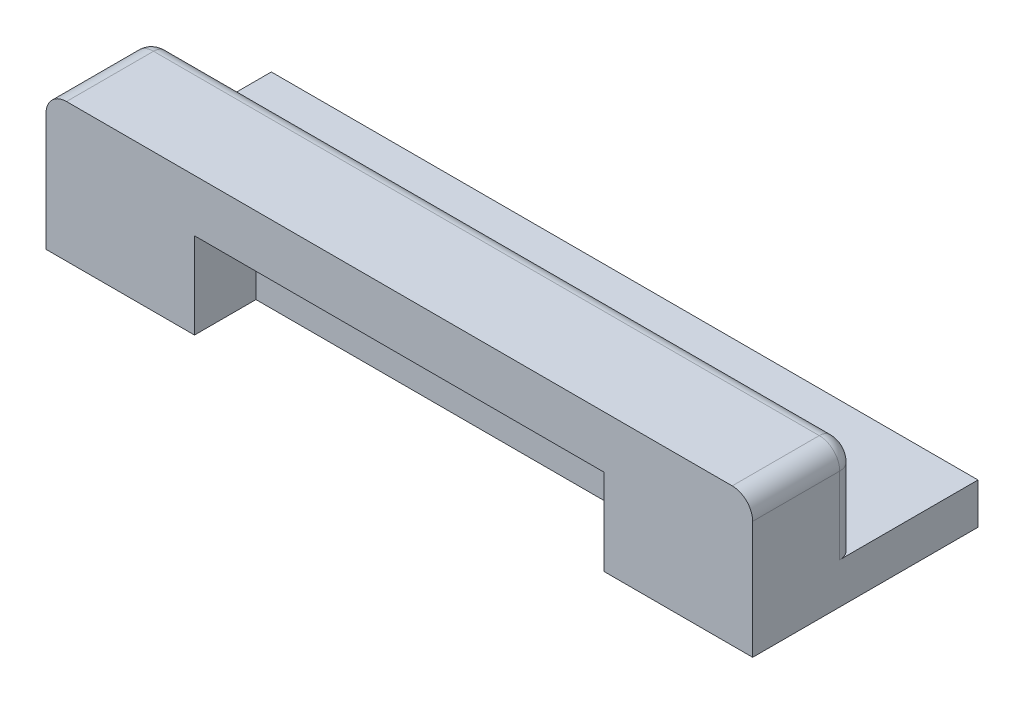
ISO-10303-21;
HEADER;
FILE_DESCRIPTION(('STEP AP214'),'2;1');
FILE_NAME('part.step','',(''),(''),'','','');
FILE_SCHEMA(('AUTOMOTIVE_DESIGN { 1 0 10303 214 1 1 1 1 }'));
ENDSEC;
DATA;
#1=APPLICATION_CONTEXT('core data for automotive mechanical design processes');
#2=APPLICATION_PROTOCOL_DEFINITION('international standard','automotive_design',2000,#1);
#3=PRODUCT_CONTEXT('',#1,'mechanical');
#4=PRODUCT('Part','Part','',(#3));
#5=PRODUCT_RELATED_PRODUCT_CATEGORY('part','',(#4));
#6=PRODUCT_DEFINITION_FORMATION('','',#4);
#7=PRODUCT_DEFINITION_CONTEXT('part definition',#1,'design');
#8=PRODUCT_DEFINITION('design','',#6,#7);
#9=PRODUCT_DEFINITION_SHAPE('','',#8);
#10=(LENGTH_UNIT() NAMED_UNIT(*) SI_UNIT(.MILLI.,.METRE.));
#11=(NAMED_UNIT(*) PLANE_ANGLE_UNIT() SI_UNIT($,.RADIAN.));
#12=(NAMED_UNIT(*) SI_UNIT($,.STERADIAN.) SOLID_ANGLE_UNIT());
#13=UNCERTAINTY_MEASURE_WITH_UNIT(LENGTH_MEASURE(1.E-05),#10,'distance_accuracy_value','');
#14=(GEOMETRIC_REPRESENTATION_CONTEXT(3) GLOBAL_UNCERTAINTY_ASSIGNED_CONTEXT((#13)) GLOBAL_UNIT_ASSIGNED_CONTEXT((#10,
#11,#12)) REPRESENTATION_CONTEXT('',''));
#15=CARTESIAN_POINT('',(0.,0.,0.));
#16=DIRECTION('',(0.,0.,1.));
#17=DIRECTION('',(1.,0.,0.));
#18=AXIS2_PLACEMENT_3D('',#15,#16,#17);
#19=CARTESIAN_POINT('',(-34.5,12.5,1.));
#20=DIRECTION('',(0.,0.,1.));
#21=DIRECTION('',(1.,0.,0.));
#22=AXIS2_PLACEMENT_3D('',#19,#20,#21);
#23=PLANE('',#22);
#24=CARTESIAN_POINT('',(32.5,10.5,1.));
#25=DIRECTION('',(0.,0.,1.));
#26=DIRECTION('',(1.,0.,0.));
#27=AXIS2_PLACEMENT_3D('',#24,#25,#26);
#28=CIRCLE('',#27,0.5);
#29=CARTESIAN_POINT('',(32.5,11.,1.));
#30=VERTEX_POINT('',#29);
#31=CARTESIAN_POINT('',(33.,10.5,1.));
#32=VERTEX_POINT('',#31);
#33=EDGE_CURVE('E280',#30,#32,#28,.F.);
#34=ORIENTED_EDGE('',*,*,#33,.T.);
#35=DIRECTION('',(0.,-1.,0.));
#36=VECTOR('',#35,1.);
#37=CARTESIAN_POINT('',(33.,3.,1.));
#38=LINE('',#37,#36);
#39=CARTESIAN_POINT('',(33.,3.,1.));
#40=VERTEX_POINT('',#39);
#41=EDGE_CURVE('E282',#32,#40,#38,.T.);
#42=ORIENTED_EDGE('',*,*,#41,.T.);
#43=DIRECTION('',(-1.,0.,0.));
#44=VECTOR('',#43,1.);
#45=CARTESIAN_POINT('',(-34.5,3.,1.));
#46=LINE('',#45,#44);
#47=CARTESIAN_POINT('',(31.5,3.,1.));
#48=VERTEX_POINT('',#47);
#49=EDGE_CURVE('E230',#40,#48,#46,.T.);
#50=ORIENTED_EDGE('',*,*,#49,.T.);
#51=DIRECTION('',(0.,1.,0.));
#52=VECTOR('',#51,1.);
#53=CARTESIAN_POINT('',(31.5,3.,1.));
#54=LINE('',#53,#52);
#55=CARTESIAN_POINT('',(31.5,7.5,1.));
#56=VERTEX_POINT('',#55);
#57=EDGE_CURVE('E205',#48,#56,#54,.T.);
#58=ORIENTED_EDGE('',*,*,#57,.T.);
#59=DIRECTION('',(1.,0.,0.));
#60=VECTOR('',#59,1.);
#61=CARTESIAN_POINT('',(-31.5,7.5,1.));
#62=LINE('',#61,#60);
#63=CARTESIAN_POINT('',(-31.5,7.5,1.));
#64=VERTEX_POINT('',#63);
#65=EDGE_CURVE('E221',#64,#56,#62,.T.);
#66=ORIENTED_EDGE('',*,*,#65,.F.);
#67=DIRECTION('',(0.,1.,0.));
#68=VECTOR('',#67,1.);
#69=CARTESIAN_POINT('',(-31.5,3.,1.));
#70=LINE('',#69,#68);
#71=CARTESIAN_POINT('',(-31.5,3.,1.));
#72=VERTEX_POINT('',#71);
#73=EDGE_CURVE('E208',#72,#64,#70,.T.);
#74=ORIENTED_EDGE('',*,*,#73,.F.);
#75=CARTESIAN_POINT('',(-33.,3.,1.));
#76=VERTEX_POINT('',#75);
#77=EDGE_CURVE('E226',#72,#76,#46,.T.);
#78=ORIENTED_EDGE('',*,*,#77,.T.);
#79=DIRECTION('',(0.,-1.,0.));
#80=VECTOR('',#79,1.);
#81=CARTESIAN_POINT('',(-33.,10.5,1.));
#82=LINE('',#81,#80);
#83=CARTESIAN_POINT('',(-33.,10.5,1.));
#84=VERTEX_POINT('',#83);
#85=EDGE_CURVE('E278',#76,#84,#82,.F.);
#86=ORIENTED_EDGE('',*,*,#85,.T.);
#87=CARTESIAN_POINT('',(-32.5,10.5,1.));
#88=DIRECTION('',(0.,0.,1.));
#89=DIRECTION('',(1.,0.,0.));
#90=AXIS2_PLACEMENT_3D('',#87,#88,#89);
#91=CIRCLE('',#90,0.5);
#92=CARTESIAN_POINT('',(-32.5,11.,1.));
#93=VERTEX_POINT('',#92);
#94=EDGE_CURVE('E276',#84,#93,#91,.F.);
#95=ORIENTED_EDGE('',*,*,#94,.T.);
#96=DIRECTION('',(-1.,0.,0.));
#97=VECTOR('',#96,1.);
#98=CARTESIAN_POINT('',(-34.5,11.,1.));
#99=LINE('',#98,#97);
#100=EDGE_CURVE('E274',#93,#30,#99,.F.);
#101=ORIENTED_EDGE('',*,*,#100,.T.);
#102=EDGE_LOOP('',(#34,#42,#50,#58,#66,#74,#78,#86,#95,#101));
#103=FACE_BOUND('',#102,.T.);
#104=ADVANCED_FACE('F35',(#103),#23,.F.);
#105=CARTESIAN_POINT('',(0.,3.,0.));
#106=DIRECTION('',(0.,-1.,0.));
#107=DIRECTION('',(0.,0.,-1.));
#108=AXIS2_PLACEMENT_3D('',#105,#106,#107);
#109=PLANE('',#108);
#110=ORIENTED_EDGE('',*,*,#49,.F.);
#111=CARTESIAN_POINT('',(33.,3.,2.5));
#112=DIRECTION('',(0.,-1.,0.));
#113=DIRECTION('',(0.,0.,-1.));
#114=AXIS2_PLACEMENT_3D('',#111,#112,#113);
#115=CIRCLE('',#114,1.5);
#116=CARTESIAN_POINT('',(34.5,3.,2.5));
#117=VERTEX_POINT('',#116);
#118=EDGE_CURVE('E44',#40,#117,#115,.T.);
#119=ORIENTED_EDGE('',*,*,#118,.T.);
#120=DIRECTION('',(0.,0.,-1.));
#121=VECTOR('',#120,1.);
#122=CARTESIAN_POINT('',(34.5,3.,-11.));
#123=LINE('',#122,#121);
#124=CARTESIAN_POINT('',(34.5,3.,-11.));
#125=VERTEX_POINT('',#124);
#126=EDGE_CURVE('E233',#117,#125,#123,.T.);
#127=ORIENTED_EDGE('',*,*,#126,.T.);
#128=DIRECTION('',(-1.,0.,0.));
#129=VECTOR('',#128,1.);
#130=CARTESIAN_POINT('',(34.5,3.,-11.));
#131=LINE('',#130,#129);
#132=CARTESIAN_POINT('',(-34.5,3.,-11.));
#133=VERTEX_POINT('',#132);
#134=EDGE_CURVE('E235',#125,#133,#131,.T.);
#135=ORIENTED_EDGE('',*,*,#134,.T.);
#136=DIRECTION('',(0.,0.,1.));
#137=VECTOR('',#136,1.);
#138=CARTESIAN_POINT('',(-34.5,3.,-11.));
#139=LINE('',#138,#137);
#140=CARTESIAN_POINT('',(-34.5,3.,2.5));
#141=VERTEX_POINT('',#140);
#142=EDGE_CURVE('E59',#133,#141,#139,.T.);
#143=ORIENTED_EDGE('',*,*,#142,.T.);
#144=CARTESIAN_POINT('',(-33.,3.,2.5));
#145=DIRECTION('',(0.,-1.,0.));
#146=DIRECTION('',(0.,0.,-1.));
#147=AXIS2_PLACEMENT_3D('',#144,#145,#146);
#148=CIRCLE('',#147,1.5);
#149=EDGE_CURVE('E11',#141,#76,#148,.T.);
#150=ORIENTED_EDGE('',*,*,#149,.T.);
#151=ORIENTED_EDGE('',*,*,#77,.F.);
#152=DIRECTION('',(1.,0.,0.));
#153=VECTOR('',#152,1.);
#154=CARTESIAN_POINT('',(-31.5,3.,1.));
#155=LINE('',#154,#153);
#156=EDGE_CURVE('E211',#72,#48,#155,.T.);
#157=ORIENTED_EDGE('',*,*,#156,.T.);
#158=EDGE_LOOP('',(#110,#119,#127,#135,#143,#150,#151,#157));
#159=FACE_BOUND('',#158,.T.);
#160=ADVANCED_FACE('F343',(#159),#109,.F.);
#161=CARTESIAN_POINT('',(-34.5,-1.,-11.));
#162=DIRECTION('',(-1.,0.,0.));
#163=DIRECTION('',(0.,0.,1.));
#164=AXIS2_PLACEMENT_3D('',#161,#162,#163);
#165=PLANE('',#164);
#166=DIRECTION('',(0.,0.,1.));
#167=VECTOR('',#166,1.);
#168=CARTESIAN_POINT('',(-34.5,10.5,1.));
#169=LINE('',#168,#167);
#170=CARTESIAN_POINT('',(-34.5,10.5,11.));
#171=VERTEX_POINT('',#170);
#172=CARTESIAN_POINT('',(-34.5,10.5,2.5));
#173=VERTEX_POINT('',#172);
#174=EDGE_CURVE('E269',#171,#173,#169,.F.);
#175=ORIENTED_EDGE('',*,*,#174,.T.);
#176=DIRECTION('',(0.,-1.,0.));
#177=VECTOR('',#176,1.);
#178=CARTESIAN_POINT('',(-34.5,3.,2.5));
#179=LINE('',#178,#177);
#180=EDGE_CURVE('E289',#173,#141,#179,.T.);
#181=ORIENTED_EDGE('',*,*,#180,.T.);
#182=ORIENTED_EDGE('',*,*,#142,.F.);
#183=DIRECTION('',(0.,1.,0.));
#184=VECTOR('',#183,1.);
#185=CARTESIAN_POINT('',(-34.5,-1.,-11.));
#186=LINE('',#185,#184);
#187=CARTESIAN_POINT('',(-34.5,-1.,-11.));
#188=VERTEX_POINT('',#187);
#189=EDGE_CURVE('E251',#188,#133,#186,.T.);
#190=ORIENTED_EDGE('',*,*,#189,.F.);
#191=DIRECTION('',(0.,0.,1.));
#192=VECTOR('',#191,1.);
#193=CARTESIAN_POINT('',(-34.5,-1.,-11.));
#194=LINE('',#193,#192);
#195=CARTESIAN_POINT('',(-34.5,-1.,11.));
#196=VERTEX_POINT('',#195);
#197=EDGE_CURVE('E237',#188,#196,#194,.T.);
#198=ORIENTED_EDGE('',*,*,#197,.T.);
#199=DIRECTION('',(0.,1.,0.));
#200=VECTOR('',#199,1.);
#201=CARTESIAN_POINT('',(-34.5,-1.,11.));
#202=LINE('',#201,#200);
#203=EDGE_CURVE('E250',#196,#171,#202,.T.);
#204=ORIENTED_EDGE('',*,*,#203,.T.);
#205=EDGE_LOOP('',(#175,#181,#182,#190,#198,#204));
#206=FACE_BOUND('',#205,.T.);
#207=ADVANCED_FACE('F317',(#206),#165,.T.);
#208=CARTESIAN_POINT('',(34.5,-1.,-11.));
#209=DIRECTION('',(0.,0.,-1.));
#210=DIRECTION('',(-1.,0.,0.));
#211=AXIS2_PLACEMENT_3D('',#208,#209,#210);
#212=PLANE('',#211);
#213=ORIENTED_EDGE('',*,*,#189,.T.);
#214=ORIENTED_EDGE('',*,*,#134,.F.);
#215=DIRECTION('',(0.,1.,0.));
#216=VECTOR('',#215,1.);
#217=CARTESIAN_POINT('',(34.5,-1.,-11.));
#218=LINE('',#217,#216);
#219=CARTESIAN_POINT('',(34.5,-1.,-11.));
#220=VERTEX_POINT('',#219);
#221=EDGE_CURVE('E254',#220,#125,#218,.T.);
#222=ORIENTED_EDGE('',*,*,#221,.F.);
#223=DIRECTION('',(-1.,0.,0.));
#224=VECTOR('',#223,1.);
#225=CARTESIAN_POINT('',(34.5,-1.,-11.));
#226=LINE('',#225,#224);
#227=EDGE_CURVE('E247',#220,#188,#226,.T.);
#228=ORIENTED_EDGE('',*,*,#227,.T.);
#229=EDGE_LOOP('',(#213,#214,#222,#228));
#230=FACE_BOUND('',#229,.T.);
#231=ADVANCED_FACE('F383',(#230),#212,.T.);
#232=CARTESIAN_POINT('',(34.5,-1.,-11.));
#233=DIRECTION('',(1.,0.,0.));
#234=DIRECTION('',(0.,0.,-1.));
#235=AXIS2_PLACEMENT_3D('',#232,#233,#234);
#236=PLANE('',#235);
#237=ORIENTED_EDGE('',*,*,#126,.F.);
#238=DIRECTION('',(0.,-1.,0.));
#239=VECTOR('',#238,1.);
#240=CARTESIAN_POINT('',(34.5,10.5,2.5));
#241=LINE('',#240,#239);
#242=CARTESIAN_POINT('',(34.5,10.5,2.5));
#243=VERTEX_POINT('',#242);
#244=EDGE_CURVE('E285',#117,#243,#241,.F.);
#245=ORIENTED_EDGE('',*,*,#244,.T.);
#246=DIRECTION('',(0.,0.,-1.));
#247=VECTOR('',#246,1.);
#248=CARTESIAN_POINT('',(34.5,10.5,11.));
#249=LINE('',#248,#247);
#250=CARTESIAN_POINT('',(34.5,10.5,11.));
#251=VERTEX_POINT('',#250);
#252=EDGE_CURVE('E272',#243,#251,#249,.F.);
#253=ORIENTED_EDGE('',*,*,#252,.T.);
#254=DIRECTION('',(0.,1.,0.));
#255=VECTOR('',#254,1.);
#256=CARTESIAN_POINT('',(34.5,-1.,11.));
#257=LINE('',#256,#255);
#258=CARTESIAN_POINT('',(34.5,-1.,11.));
#259=VERTEX_POINT('',#258);
#260=EDGE_CURVE('E257',#259,#251,#257,.T.);
#261=ORIENTED_EDGE('',*,*,#260,.F.);
#262=DIRECTION('',(0.,0.,-1.));
#263=VECTOR('',#262,1.);
#264=CARTESIAN_POINT('',(34.5,-1.,-11.));
#265=LINE('',#264,#263);
#266=EDGE_CURVE('E244',#259,#220,#265,.T.);
#267=ORIENTED_EDGE('',*,*,#266,.T.);
#268=ORIENTED_EDGE('',*,*,#221,.T.);
#269=EDGE_LOOP('',(#237,#245,#253,#261,#267,#268));
#270=FACE_BOUND('',#269,.T.);
#271=ADVANCED_FACE('F386',(#270),#236,.T.);
#272=CARTESIAN_POINT('',(34.5,-1.,11.));
#273=DIRECTION('',(0.,0.,1.));
#274=DIRECTION('',(1.,0.,0.));
#275=AXIS2_PLACEMENT_3D('',#272,#273,#274);
#276=PLANE('',#275);
#277=DIRECTION('',(1.,0.,0.));
#278=VECTOR('',#277,1.);
#279=CARTESIAN_POINT('',(-34.5,12.5,11.));
#280=LINE('',#279,#278);
#281=CARTESIAN_POINT('',(-32.5,12.5,11.));
#282=VERTEX_POINT('',#281);
#283=CARTESIAN_POINT('',(32.5,12.5,11.));
#284=VERTEX_POINT('',#283);
#285=EDGE_CURVE('E227',#282,#284,#280,.T.);
#286=ORIENTED_EDGE('',*,*,#285,.F.);
#287=CARTESIAN_POINT('',(-32.5,10.5,11.));
#288=DIRECTION('',(0.,0.,1.));
#289=DIRECTION('',(1.,0.,0.));
#290=AXIS2_PLACEMENT_3D('',#287,#288,#289);
#291=CIRCLE('',#290,2.);
#292=EDGE_CURVE('E267',#282,#171,#291,.T.);
#293=ORIENTED_EDGE('',*,*,#292,.T.);
#294=ORIENTED_EDGE('',*,*,#203,.F.);
#295=DIRECTION('',(1.,0.,0.));
#296=VECTOR('',#295,1.);
#297=CARTESIAN_POINT('',(34.5,-1.,11.));
#298=LINE('',#297,#296);
#299=CARTESIAN_POINT('',(-20.,-1.00000000000001,11.));
#300=VERTEX_POINT('',#299);
#301=EDGE_CURVE('E241',#196,#300,#298,.T.);
#302=ORIENTED_EDGE('',*,*,#301,.T.);
#303=DIRECTION('',(0.,-1.,0.));
#304=VECTOR('',#303,1.);
#305=CARTESIAN_POINT('',(-20.,-1.00000000000001,11.));
#306=LINE('',#305,#304);
#307=CARTESIAN_POINT('',(-20.,7.4,11.));
#308=VERTEX_POINT('',#307);
#309=EDGE_CURVE('E186',#308,#300,#306,.T.);
#310=ORIENTED_EDGE('',*,*,#309,.F.);
#311=DIRECTION('',(-1.,0.,0.));
#312=VECTOR('',#311,1.);
#313=CARTESIAN_POINT('',(20.,7.4,11.));
#314=LINE('',#313,#312);
#315=CARTESIAN_POINT('',(20.,7.4,11.));
#316=VERTEX_POINT('',#315);
#317=EDGE_CURVE('E188',#316,#308,#314,.T.);
#318=ORIENTED_EDGE('',*,*,#317,.F.);
#319=DIRECTION('',(0.,1.,0.));
#320=VECTOR('',#319,1.);
#321=CARTESIAN_POINT('',(20.,-1.00000000000001,11.));
#322=LINE('',#321,#320);
#323=CARTESIAN_POINT('',(20.,-1.00000000000001,11.));
#324=VERTEX_POINT('',#323);
#325=EDGE_CURVE('E169',#324,#316,#322,.T.);
#326=ORIENTED_EDGE('',*,*,#325,.F.);
#327=EDGE_CURVE('E240',#324,#259,#298,.T.);
#328=ORIENTED_EDGE('',*,*,#327,.T.);
#329=ORIENTED_EDGE('',*,*,#260,.T.);
#330=CARTESIAN_POINT('',(32.5,10.5,11.));
#331=DIRECTION('',(0.,0.,1.));
#332=DIRECTION('',(1.,0.,0.));
#333=AXIS2_PLACEMENT_3D('',#330,#331,#332);
#334=CIRCLE('',#333,2.);
#335=EDGE_CURVE('E265',#251,#284,#334,.T.);
#336=ORIENTED_EDGE('',*,*,#335,.T.);
#337=EDGE_LOOP('',(#286,#293,#294,#302,#310,#318,#326,#328,#329,#336));
#338=FACE_BOUND('',#337,.T.);
#339=ADVANCED_FACE('F381',(#338),#276,.T.);
#340=CARTESIAN_POINT('',(0.,-1.,0.));
#341=DIRECTION('',(0.,-1.,0.));
#342=DIRECTION('',(0.,0.,-1.));
#343=AXIS2_PLACEMENT_3D('',#340,#341,#342);
#344=PLANE('',#343);
#345=DIRECTION('',(0.,0.,1.));
#346=VECTOR('',#345,1.);
#347=CARTESIAN_POINT('',(20.,-1.00000000000001,5.));
#348=LINE('',#347,#346);
#349=CARTESIAN_POINT('',(20.,-1.00000000000001,5.));
#350=VERTEX_POINT('',#349);
#351=EDGE_CURVE('E195',#350,#324,#348,.T.);
#352=ORIENTED_EDGE('',*,*,#351,.F.);
#353=DIRECTION('',(1.,0.,0.));
#354=VECTOR('',#353,1.);
#355=CARTESIAN_POINT('',(20.,-1.00000000000001,5.));
#356=LINE('',#355,#354);
#357=CARTESIAN_POINT('',(-20.,-1.,5.));
#358=VERTEX_POINT('',#357);
#359=EDGE_CURVE('E174',#358,#350,#356,.T.);
#360=ORIENTED_EDGE('',*,*,#359,.F.);
#361=DIRECTION('',(0.,0.,1.));
#362=VECTOR('',#361,1.);
#363=CARTESIAN_POINT('',(-20.,-1.00000000000001,5.));
#364=LINE('',#363,#362);
#365=EDGE_CURVE('E198',#358,#300,#364,.T.);
#366=ORIENTED_EDGE('',*,*,#365,.T.);
#367=ORIENTED_EDGE('',*,*,#301,.F.);
#368=ORIENTED_EDGE('',*,*,#197,.F.);
#369=ORIENTED_EDGE('',*,*,#227,.F.);
#370=ORIENTED_EDGE('',*,*,#266,.F.);
#371=ORIENTED_EDGE('',*,*,#327,.F.);
#372=EDGE_LOOP('',(#352,#360,#366,#367,#368,#369,#370,#371));
#373=FACE_BOUND('',#372,.T.);
#374=ADVANCED_FACE('F378',(#373),#344,.T.);
#375=CARTESIAN_POINT('',(0.,12.5,0.));
#376=DIRECTION('',(0.,-1.,0.));
#377=DIRECTION('',(0.,0.,-1.));
#378=AXIS2_PLACEMENT_3D('',#375,#376,#377);
#379=PLANE('',#378);
#380=DIRECTION('',(0.,0.,-1.));
#381=VECTOR('',#380,1.);
#382=CARTESIAN_POINT('',(32.5,12.5,1.));
#383=LINE('',#382,#381);
#384=CARTESIAN_POINT('',(32.5,12.5,2.5));
#385=VERTEX_POINT('',#384);
#386=EDGE_CURVE('E253',#284,#385,#383,.T.);
#387=ORIENTED_EDGE('',*,*,#386,.T.);
#388=DIRECTION('',(-1.,0.,0.));
#389=VECTOR('',#388,1.);
#390=CARTESIAN_POINT('',(0.,12.5,2.5));
#391=LINE('',#390,#389);
#392=CARTESIAN_POINT('',(-32.5,12.5,2.5));
#393=VERTEX_POINT('',#392);
#394=EDGE_CURVE('E52',#385,#393,#391,.T.);
#395=ORIENTED_EDGE('',*,*,#394,.T.);
#396=DIRECTION('',(0.,0.,1.));
#397=VECTOR('',#396,1.);
#398=CARTESIAN_POINT('',(-32.5,12.5,11.));
#399=LINE('',#398,#397);
#400=EDGE_CURVE('E263',#393,#282,#399,.T.);
#401=ORIENTED_EDGE('',*,*,#400,.T.);
#402=ORIENTED_EDGE('',*,*,#285,.T.);
#403=EDGE_LOOP('',(#387,#395,#401,#402));
#404=FACE_BOUND('',#403,.T.);
#405=ADVANCED_FACE('F323',(#404),#379,.F.);
#406=CARTESIAN_POINT('',(-31.5,3.,1.));
#407=DIRECTION('',(0.,0.485642931178632,-0.874157276121538));
#408=DIRECTION('',(0.,0.874157276121538,0.485642931178632));
#409=AXIS2_PLACEMENT_3D('',#406,#407,#408);
#410=PLANE('',#409);
#411=DIRECTION('',(0.,0.874157276121538,0.485642931178632));
#412=VECTOR('',#411,1.);
#413=CARTESIAN_POINT('',(31.5,3.,1.));
#414=LINE('',#413,#412);
#415=CARTESIAN_POINT('',(31.5,7.5,3.5));
#416=VERTEX_POINT('',#415);
#417=EDGE_CURVE('E197',#48,#416,#414,.T.);
#418=ORIENTED_EDGE('',*,*,#417,.F.);
#419=ORIENTED_EDGE('',*,*,#156,.F.);
#420=DIRECTION('',(0.,0.874157276121538,0.485642931178632));
#421=VECTOR('',#420,1.);
#422=CARTESIAN_POINT('',(-31.5,3.,1.));
#423=LINE('',#422,#421);
#424=CARTESIAN_POINT('',(-31.5,7.5,3.5));
#425=VERTEX_POINT('',#424);
#426=EDGE_CURVE('E202',#72,#425,#423,.T.);
#427=ORIENTED_EDGE('',*,*,#426,.T.);
#428=DIRECTION('',(1.,0.,0.));
#429=VECTOR('',#428,1.);
#430=CARTESIAN_POINT('',(-31.5,7.5,3.5));
#431=LINE('',#430,#429);
#432=EDGE_CURVE('E224',#425,#416,#431,.T.);
#433=ORIENTED_EDGE('',*,*,#432,.T.);
#434=EDGE_LOOP('',(#418,#419,#427,#433));
#435=FACE_BOUND('',#434,.T.);
#436=ADVANCED_FACE('F348',(#435),#410,.T.);
#437=CARTESIAN_POINT('',(-31.5,7.5,1.));
#438=DIRECTION('',(0.,1.,0.));
#439=DIRECTION('',(0.,0.,1.));
#440=AXIS2_PLACEMENT_3D('',#437,#438,#439);
#441=PLANE('',#440);
#442=DIRECTION('',(0.,0.,1.));
#443=VECTOR('',#442,1.);
#444=CARTESIAN_POINT('',(31.5,7.5,1.));
#445=LINE('',#444,#443);
#446=EDGE_CURVE('E214',#56,#416,#445,.T.);
#447=ORIENTED_EDGE('',*,*,#446,.T.);
#448=ORIENTED_EDGE('',*,*,#432,.F.);
#449=DIRECTION('',(0.,0.,1.));
#450=VECTOR('',#449,1.);
#451=CARTESIAN_POINT('',(-31.5,7.5,1.));
#452=LINE('',#451,#450);
#453=EDGE_CURVE('E204',#64,#425,#452,.T.);
#454=ORIENTED_EDGE('',*,*,#453,.F.);
#455=ORIENTED_EDGE('',*,*,#65,.T.);
#456=EDGE_LOOP('',(#447,#448,#454,#455));
#457=FACE_BOUND('',#456,.T.);
#458=ADVANCED_FACE('F356',(#457),#441,.F.);
#459=CARTESIAN_POINT('',(-31.5,0.,0.));
#460=DIRECTION('',(1.,0.,0.));
#461=DIRECTION('',(0.,0.,-1.));
#462=AXIS2_PLACEMENT_3D('',#459,#460,#461);
#463=PLANE('',#462);
#464=ORIENTED_EDGE('',*,*,#426,.F.);
#465=ORIENTED_EDGE('',*,*,#73,.T.);
#466=ORIENTED_EDGE('',*,*,#453,.T.);
#467=EDGE_LOOP('',(#464,#465,#466));
#468=FACE_BOUND('',#467,.T.);
#469=ADVANCED_FACE('F353',(#468),#463,.T.);
#470=CARTESIAN_POINT('',(31.5,0.,0.));
#471=DIRECTION('',(1.,0.,0.));
#472=DIRECTION('',(0.,0.,-1.));
#473=AXIS2_PLACEMENT_3D('',#470,#471,#472);
#474=PLANE('',#473);
#475=ORIENTED_EDGE('',*,*,#417,.T.);
#476=ORIENTED_EDGE('',*,*,#446,.F.);
#477=ORIENTED_EDGE('',*,*,#57,.F.);
#478=EDGE_LOOP('',(#475,#476,#477));
#479=FACE_BOUND('',#478,.T.);
#480=ADVANCED_FACE('F358',(#479),#474,.F.);
#481=CARTESIAN_POINT('',(20.,-1.00000000000001,5.));
#482=DIRECTION('',(1.,0.,0.));
#483=DIRECTION('',(0.,0.,-1.));
#484=AXIS2_PLACEMENT_3D('',#481,#482,#483);
#485=PLANE('',#484);
#486=ORIENTED_EDGE('',*,*,#325,.T.);
#487=DIRECTION('',(0.,0.,1.));
#488=VECTOR('',#487,1.);
#489=CARTESIAN_POINT('',(20.,7.4,5.));
#490=LINE('',#489,#488);
#491=CARTESIAN_POINT('',(20.,7.4,5.));
#492=VERTEX_POINT('',#491);
#493=EDGE_CURVE('E162',#492,#316,#490,.T.);
#494=ORIENTED_EDGE('',*,*,#493,.F.);
#495=DIRECTION('',(0.,1.,0.));
#496=VECTOR('',#495,1.);
#497=CARTESIAN_POINT('',(20.,-1.00000000000001,5.));
#498=LINE('',#497,#496);
#499=EDGE_CURVE('E166',#350,#492,#498,.T.);
#500=ORIENTED_EDGE('',*,*,#499,.F.);
#501=ORIENTED_EDGE('',*,*,#351,.T.);
#502=EDGE_LOOP('',(#486,#494,#500,#501));
#503=FACE_BOUND('',#502,.T.);
#504=ADVANCED_FACE('F164',(#503),#485,.F.);
#505=CARTESIAN_POINT('',(-20.,-1.00000000000001,5.));
#506=DIRECTION('',(-1.,0.,0.));
#507=DIRECTION('',(0.,0.,1.));
#508=AXIS2_PLACEMENT_3D('',#505,#506,#507);
#509=PLANE('',#508);
#510=ORIENTED_EDGE('',*,*,#309,.T.);
#511=ORIENTED_EDGE('',*,*,#365,.F.);
#512=DIRECTION('',(0.,-1.,0.));
#513=VECTOR('',#512,1.);
#514=CARTESIAN_POINT('',(-20.,-1.00000000000001,5.));
#515=LINE('',#514,#513);
#516=CARTESIAN_POINT('',(-20.,7.4,5.));
#517=VERTEX_POINT('',#516);
#518=EDGE_CURVE('E181',#517,#358,#515,.T.);
#519=ORIENTED_EDGE('',*,*,#518,.F.);
#520=DIRECTION('',(0.,0.,1.));
#521=VECTOR('',#520,1.);
#522=CARTESIAN_POINT('',(-20.,7.4,5.));
#523=LINE('',#522,#521);
#524=EDGE_CURVE('E173',#517,#308,#523,.T.);
#525=ORIENTED_EDGE('',*,*,#524,.T.);
#526=EDGE_LOOP('',(#510,#511,#519,#525));
#527=FACE_BOUND('',#526,.T.);
#528=ADVANCED_FACE('F365',(#527),#509,.F.);
#529=CARTESIAN_POINT('',(20.,7.4,5.));
#530=DIRECTION('',(0.,1.,0.));
#531=DIRECTION('',(0.,0.,1.));
#532=AXIS2_PLACEMENT_3D('',#529,#530,#531);
#533=PLANE('',#532);
#534=ORIENTED_EDGE('',*,*,#317,.T.);
#535=ORIENTED_EDGE('',*,*,#524,.F.);
#536=DIRECTION('',(-1.,0.,0.));
#537=VECTOR('',#536,1.);
#538=CARTESIAN_POINT('',(20.,7.4,5.));
#539=LINE('',#538,#537);
#540=EDGE_CURVE('E177',#492,#517,#539,.T.);
#541=ORIENTED_EDGE('',*,*,#540,.F.);
#542=ORIENTED_EDGE('',*,*,#493,.T.);
#543=EDGE_LOOP('',(#534,#535,#541,#542));
#544=FACE_BOUND('',#543,.T.);
#545=ADVANCED_FACE('F178',(#544),#533,.F.);
#546=CARTESIAN_POINT('',(0.,0.,5.));
#547=DIRECTION('',(0.,0.,1.));
#548=DIRECTION('',(1.,0.,0.));
#549=AXIS2_PLACEMENT_3D('',#546,#547,#548);
#550=PLANE('',#549);
#551=ORIENTED_EDGE('',*,*,#499,.T.);
#552=ORIENTED_EDGE('',*,*,#540,.T.);
#553=ORIENTED_EDGE('',*,*,#518,.T.);
#554=ORIENTED_EDGE('',*,*,#359,.T.);
#555=EDGE_LOOP('',(#551,#552,#553,#554));
#556=FACE_BOUND('',#555,.T.);
#557=ADVANCED_FACE('F183',(#556),#550,.T.);
#558=CARTESIAN_POINT('',(-32.5,10.5,0.));
#559=DIRECTION('',(0.,0.,-1.));
#560=DIRECTION('',(-1.,0.,0.));
#561=AXIS2_PLACEMENT_3D('',#558,#559,#560);
#562=CYLINDRICAL_SURFACE('',#561,2.);
#563=ORIENTED_EDGE('',*,*,#400,.F.);
#564=CARTESIAN_POINT('',(-32.5,10.5,2.5));
#565=DIRECTION('',(0.,0.,1.));
#566=DIRECTION('',(1.,0.,0.));
#567=AXIS2_PLACEMENT_3D('',#564,#565,#566);
#568=CIRCLE('',#567,2.);
#569=EDGE_CURVE('E291',#393,#173,#568,.T.);
#570=ORIENTED_EDGE('',*,*,#569,.T.);
#571=ORIENTED_EDGE('',*,*,#174,.F.);
#572=ORIENTED_EDGE('',*,*,#292,.F.);
#573=EDGE_LOOP('',(#563,#570,#571,#572));
#574=FACE_BOUND('',#573,.T.);
#575=ADVANCED_FACE('F321',(#574),#562,.T.);
#576=CARTESIAN_POINT('',(32.5,10.5,0.));
#577=DIRECTION('',(0.,0.,1.));
#578=DIRECTION('',(1.,0.,0.));
#579=AXIS2_PLACEMENT_3D('',#576,#577,#578);
#580=CYLINDRICAL_SURFACE('',#579,2.);
#581=ORIENTED_EDGE('',*,*,#252,.F.);
#582=CARTESIAN_POINT('',(32.5,10.5,2.5));
#583=DIRECTION('',(0.,0.,1.));
#584=DIRECTION('',(1.,0.,0.));
#585=AXIS2_PLACEMENT_3D('',#582,#583,#584);
#586=CIRCLE('',#585,2.);
#587=EDGE_CURVE('E287',#243,#385,#586,.T.);
#588=ORIENTED_EDGE('',*,*,#587,.T.);
#589=ORIENTED_EDGE('',*,*,#386,.F.);
#590=ORIENTED_EDGE('',*,*,#335,.F.);
#591=EDGE_LOOP('',(#581,#588,#589,#590));
#592=FACE_BOUND('',#591,.T.);
#593=ADVANCED_FACE('F329',(#592),#580,.T.);
#594=CARTESIAN_POINT('',(-33.,-1.,2.5));
#595=DIRECTION('',(0.,1.,0.));
#596=DIRECTION('',(0.,0.,1.));
#597=AXIS2_PLACEMENT_3D('',#594,#595,#596);
#598=CYLINDRICAL_SURFACE('',#597,1.5);
#599=ORIENTED_EDGE('',*,*,#149,.F.);
#600=ORIENTED_EDGE('',*,*,#180,.F.);
#601=CARTESIAN_POINT('',(-33.,10.5,2.5));
#602=DIRECTION('',(0.,1.,0.));
#603=DIRECTION('',(0.,0.,1.));
#604=AXIS2_PLACEMENT_3D('',#601,#602,#603);
#605=CIRCLE('',#604,1.5);
#606=EDGE_CURVE('E39',#84,#173,#605,.T.);
#607=ORIENTED_EDGE('',*,*,#606,.F.);
#608=ORIENTED_EDGE('',*,*,#85,.F.);
#609=EDGE_LOOP('',(#599,#600,#607,#608));
#610=FACE_BOUND('',#609,.T.);
#611=ADVANCED_FACE('F37',(#610),#598,.T.);
#612=CARTESIAN_POINT('',(-32.5,10.5,2.5));
#613=DIRECTION('',(0.,0.,1.));
#614=DIRECTION('',(1.,0.,0.));
#615=AXIS2_PLACEMENT_3D('',#612,#613,#614);
#616=DEGENERATE_TOROIDAL_SURFACE('',#615,0.5,1.5,.T.);
#617=ORIENTED_EDGE('',*,*,#606,.T.);
#618=ORIENTED_EDGE('',*,*,#569,.F.);
#619=CARTESIAN_POINT('',(-32.5,11.,2.5));
#620=DIRECTION('',(1.,0.,0.));
#621=DIRECTION('',(0.,0.,-1.));
#622=AXIS2_PLACEMENT_3D('',#619,#620,#621);
#623=CIRCLE('',#622,1.5);
#624=EDGE_CURVE('E301',#93,#393,#623,.T.);
#625=ORIENTED_EDGE('',*,*,#624,.F.);
#626=ORIENTED_EDGE('',*,*,#94,.F.);
#627=EDGE_LOOP('',(#617,#618,#625,#626));
#628=FACE_BOUND('',#627,.T.);
#629=ADVANCED_FACE('F311',(#628),#616,.T.);
#630=CARTESIAN_POINT('',(0.,11.,2.5));
#631=DIRECTION('',(-1.,0.,0.));
#632=DIRECTION('',(0.,0.,1.));
#633=AXIS2_PLACEMENT_3D('',#630,#631,#632);
#634=CYLINDRICAL_SURFACE('',#633,1.5);
#635=ORIENTED_EDGE('',*,*,#624,.T.);
#636=ORIENTED_EDGE('',*,*,#394,.F.);
#637=CARTESIAN_POINT('',(32.5,11.,2.5));
#638=DIRECTION('',(1.,0.,0.));
#639=DIRECTION('',(0.,0.,-1.));
#640=AXIS2_PLACEMENT_3D('',#637,#638,#639);
#641=CIRCLE('',#640,1.5);
#642=EDGE_CURVE('E299',#30,#385,#641,.T.);
#643=ORIENTED_EDGE('',*,*,#642,.F.);
#644=ORIENTED_EDGE('',*,*,#100,.F.);
#645=EDGE_LOOP('',(#635,#636,#643,#644));
#646=FACE_BOUND('',#645,.T.);
#647=ADVANCED_FACE('F403',(#646),#634,.T.);
#648=CARTESIAN_POINT('',(32.5,10.5,2.5));
#649=DIRECTION('',(0.,0.,1.));
#650=DIRECTION('',(1.,0.,0.));
#651=AXIS2_PLACEMENT_3D('',#648,#649,#650);
#652=DEGENERATE_TOROIDAL_SURFACE('',#651,0.5,1.5,.T.);
#653=ORIENTED_EDGE('',*,*,#642,.T.);
#654=ORIENTED_EDGE('',*,*,#587,.F.);
#655=CARTESIAN_POINT('',(33.,10.5,2.5));
#656=DIRECTION('',(0.,-1.,0.));
#657=DIRECTION('',(0.,0.,-1.));
#658=AXIS2_PLACEMENT_3D('',#655,#656,#657);
#659=CIRCLE('',#658,1.5);
#660=EDGE_CURVE('E296',#32,#243,#659,.T.);
#661=ORIENTED_EDGE('',*,*,#660,.F.);
#662=ORIENTED_EDGE('',*,*,#33,.F.);
#663=EDGE_LOOP('',(#653,#654,#661,#662));
#664=FACE_BOUND('',#663,.T.);
#665=ADVANCED_FACE('F333',(#664),#652,.T.);
#666=CARTESIAN_POINT('',(33.,12.5,2.5));
#667=DIRECTION('',(0.,1.,0.));
#668=DIRECTION('',(0.,0.,1.));
#669=AXIS2_PLACEMENT_3D('',#666,#667,#668);
#670=CYLINDRICAL_SURFACE('',#669,1.5);
#671=ORIENTED_EDGE('',*,*,#660,.T.);
#672=ORIENTED_EDGE('',*,*,#244,.F.);
#673=ORIENTED_EDGE('',*,*,#118,.F.);
#674=ORIENTED_EDGE('',*,*,#41,.F.);
#675=EDGE_LOOP('',(#671,#672,#673,#674));
#676=FACE_BOUND('',#675,.T.);
#677=ADVANCED_FACE('F339',(#676),#670,.T.);
#678=CLOSED_SHELL('',(#104,#160,#207,#231,#271,#339,#374,#405,#436,#458,#469,#480,#504,#528,
#545,#557,#575,#593,#611,#629,#647,#665,#677));
#679=MANIFOLD_SOLID_BREP('B2',#678);
#680=ADVANCED_BREP_SHAPE_REPRESENTATION('',(#18,#679),#14);
#681=SHAPE_DEFINITION_REPRESENTATION(#9,#680);
ENDSEC;
END-ISO-10303-21;
